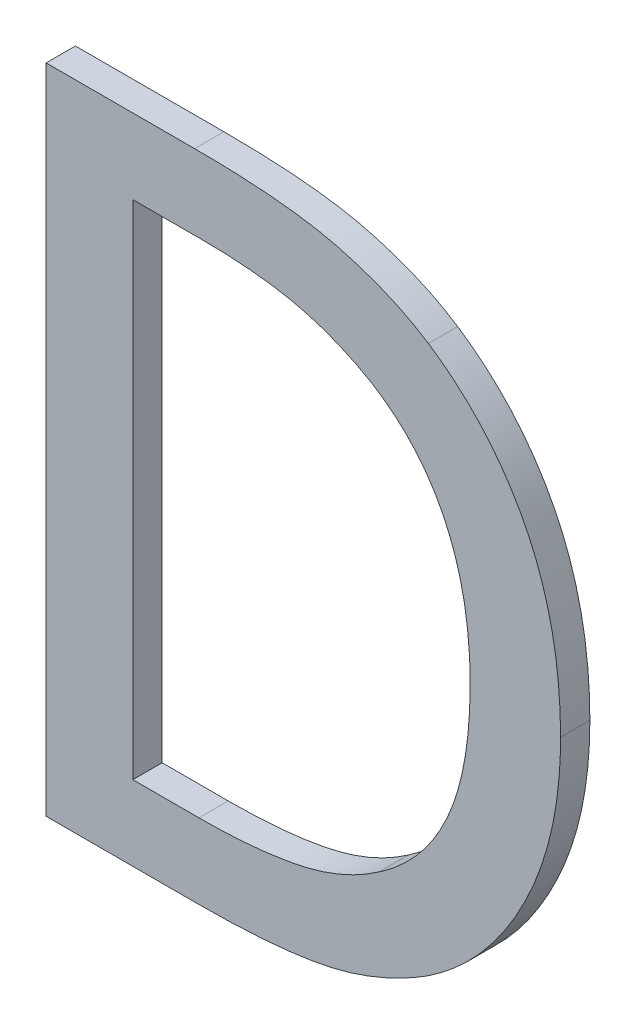
ISO-10303-21;
HEADER;
FILE_DESCRIPTION(('STEP AP214'),'2;1');
FILE_NAME('part.step','',(''),(''),'','','');
FILE_SCHEMA(('AUTOMOTIVE_DESIGN { 1 0 10303 214 1 1 1 1 }'));
ENDSEC;
DATA;
#1=APPLICATION_CONTEXT('core data for automotive mechanical design processes');
#2=APPLICATION_PROTOCOL_DEFINITION('international standard','automotive_design',2000,#1);
#3=PRODUCT_CONTEXT('',#1,'mechanical');
#4=PRODUCT('Part','Part','',(#3));
#5=PRODUCT_RELATED_PRODUCT_CATEGORY('part','',(#4));
#6=PRODUCT_DEFINITION_FORMATION('','',#4);
#7=PRODUCT_DEFINITION_CONTEXT('part definition',#1,'design');
#8=PRODUCT_DEFINITION('design','',#6,#7);
#9=PRODUCT_DEFINITION_SHAPE('','',#8);
#10=(LENGTH_UNIT() NAMED_UNIT(*) SI_UNIT(.MILLI.,.METRE.));
#11=(NAMED_UNIT(*) PLANE_ANGLE_UNIT() SI_UNIT($,.RADIAN.));
#12=(NAMED_UNIT(*) SI_UNIT($,.STERADIAN.) SOLID_ANGLE_UNIT());
#13=UNCERTAINTY_MEASURE_WITH_UNIT(LENGTH_MEASURE(1.E-05),#10,'distance_accuracy_value','');
#14=(GEOMETRIC_REPRESENTATION_CONTEXT(3) GLOBAL_UNCERTAINTY_ASSIGNED_CONTEXT((#13)) GLOBAL_UNIT_ASSIGNED_CONTEXT((#10,
#11,#12)) REPRESENTATION_CONTEXT('',''));
#15=CARTESIAN_POINT('',(0.,0.,0.));
#16=DIRECTION('',(0.,0.,1.));
#17=DIRECTION('',(1.,0.,0.));
#18=AXIS2_PLACEMENT_3D('',#15,#16,#17);
#19=CARTESIAN_POINT('',(-1.1720498035,-1.3331713862609,0.00415));
#20=DIRECTION('',(0.,0.,1.));
#21=DIRECTION('',(1.,0.,0.));
#22=AXIS2_PLACEMENT_3D('',#19,#20,#21);
#23=PLANE('',#22);
#24=CARTESIAN_POINT('',(-1.1507624098546,-1.3640414116441,0.00415));
#25=CARTESIAN_POINT('',(-1.1439127341829,-1.3595146694611,0.00415));
#26=CARTESIAN_POINT('',(-1.1357526857739,-1.3433136974374,0.00415));
#27=CARTESIAN_POINT('',(-1.1357526857739,-1.3332476523198,0.00415));
#28=B_SPLINE_CURVE_WITH_KNOTS('',2,(#24,#25,#26,#27),.UNSPECIFIED.,.F.,.F.,(3,1,3),(-2.,-1.,0.),.UNSPECIFIED.);
#29=CARTESIAN_POINT('',(-1.1507624098546,-1.3640414116441,0.00415));
#30=VERTEX_POINT('',#29);
#31=CARTESIAN_POINT('',(-1.1357526857739,-1.3332476523198,0.00415));
#32=VERTEX_POINT('',#31);
#33=EDGE_CURVE('E11',#30,#32,#28,.T.);
#34=ORIENTED_EDGE('',*,*,#33,.T.);
#35=CARTESIAN_POINT('',(-1.1357526857739,-1.3332476523198,0.00415));
#36=CARTESIAN_POINT('',(-1.1357526857739,-1.3225264208336,0.00415));
#37=CARTESIAN_POINT('',(-1.1435553598,-1.3069806351786,0.00415));
#38=CARTESIAN_POINT('',(-1.1506432850603,-1.3022752058041,0.00415));
#39=B_SPLINE_CURVE_WITH_KNOTS('',2,(#35,#36,#37,#38),.UNSPECIFIED.,.F.,.F.,(3,1,3),(-2.,-1.,0.),.UNSPECIFIED.);
#40=CARTESIAN_POINT('',(-1.1506432850603,-1.3022752058041,0.00415));
#41=VERTEX_POINT('',#40);
#42=EDGE_CURVE('E26',#32,#41,#39,.T.);
#43=ORIENTED_EDGE('',*,*,#42,.T.);
#44=CARTESIAN_POINT('',(-1.1506432850603,-1.3022752058041,0.00415));
#45=CARTESIAN_POINT('',(-1.1548126528605,-1.2995353355354,0.00415));
#46=CARTESIAN_POINT('',(-1.1666060074954,-1.2964380908838,0.00415));
#47=CARTESIAN_POINT('',(-1.1769698645987,-1.2964380908838,0.00415));
#48=B_SPLINE_CURVE_WITH_KNOTS('',2,(#44,#45,#46,#47),.UNSPECIFIED.,.F.,.F.,(3,1,3),(-2.,-1.,0.),.UNSPECIFIED.);
#49=CARTESIAN_POINT('',(-1.1769698645987,-1.2964380908838,0.00415));
#50=VERTEX_POINT('',#49);
#51=EDGE_CURVE('E290',#41,#50,#48,.T.);
#52=ORIENTED_EDGE('',*,*,#51,.T.);
#53=DIRECTION('',(-1.,0.,0.));
#54=VECTOR('',#53,1.);
#55=CARTESIAN_POINT('',(-1.1769698645987,-1.2964380908838,0.00415));
#56=LINE('',#55,#54);
#57=CARTESIAN_POINT('',(-1.1937068981966,-1.2964380908838,0.00415));
#58=VERTEX_POINT('',#57);
#59=EDGE_CURVE('E288',#50,#58,#56,.T.);
#60=ORIENTED_EDGE('',*,*,#59,.T.);
#61=DIRECTION('',(0.,-1.,0.));
#62=VECTOR('',#61,1.);
#63=CARTESIAN_POINT('',(-1.1937068981966,-1.2964380908838,0.00415));
#64=LINE('',#63,#62);
#65=CARTESIAN_POINT('',(-1.1937068981966,-1.3699380889616,0.00415));
#66=VERTEX_POINT('',#65);
#67=EDGE_CURVE('E286',#58,#66,#64,.T.);
#68=ORIENTED_EDGE('',*,*,#67,.T.);
#69=DIRECTION('',(1.,0.,0.));
#70=VECTOR('',#69,1.);
#71=CARTESIAN_POINT('',(-1.1937068981966,-1.3699380889616,0.00415));
#72=LINE('',#71,#70);
#73=CARTESIAN_POINT('',(-1.1767911774073,-1.3699380889616,0.00415));
#74=VERTEX_POINT('',#73);
#75=EDGE_CURVE('E281',#66,#74,#72,.T.);
#76=ORIENTED_EDGE('',*,*,#75,.T.);
#77=CARTESIAN_POINT('',(-1.1767911774073,-1.3699380889616,0.00415));
#78=CARTESIAN_POINT('',(-1.1678568178354,-1.3699380889616,0.00415));
#79=CARTESIAN_POINT('',(-1.1563612751863,-1.3675555930757,0.00415));
#80=CARTESIAN_POINT('',(-1.1507624098546,-1.3640414116441,0.00415));
#81=B_SPLINE_CURVE_WITH_KNOTS('',2,(#77,#78,#79,#80),.UNSPECIFIED.,.F.,.F.,(3,1,3),(-2.,-1.,0.),.UNSPECIFIED.);
#82=EDGE_CURVE('E274',#74,#30,#81,.T.);
#83=ORIENTED_EDGE('',*,*,#82,.T.);
#84=EDGE_LOOP('',(#34,#43,#52,#60,#68,#76,#83));
#85=FACE_BOUND('',#84,.T.);
#86=CARTESIAN_POINT('',(-1.1561825879949,-1.3565961120009,0.00415));
#87=CARTESIAN_POINT('',(-1.1601732686036,-1.3593955446668,0.00415));
#88=CARTESIAN_POINT('',(-1.1700010641326,-1.3614802285669,0.00415));
#89=CARTESIAN_POINT('',(-1.1764933654215,-1.3614802285669,0.00415));
#90=B_SPLINE_CURVE_WITH_KNOTS('',2,(#86,#87,#88,#89),.UNSPECIFIED.,.F.,.F.,(3,1,3),(-2.,-1.,0.),.UNSPECIFIED.);
#91=CARTESIAN_POINT('',(-1.1561825879949,-1.3565961120009,0.00415));
#92=VERTEX_POINT('',#91);
#93=CARTESIAN_POINT('',(-1.1764933654215,-1.3614802285669,0.00415));
#94=VERTEX_POINT('',#93);
#95=EDGE_CURVE('E270',#92,#94,#90,.T.);
#96=ORIENTED_EDGE('',*,*,#95,.T.);
#97=DIRECTION('',(-1.,0.,0.));
#98=VECTOR('',#97,1.);
#99=CARTESIAN_POINT('',(-1.1779942342824,-1.3614802285669,0.00415));
#100=LINE('',#99,#98);
#101=CARTESIAN_POINT('',(-1.1839386650647,-1.3614802285669,0.00415));
#102=VERTEX_POINT('',#101);
#103=EDGE_CURVE('E268',#94,#102,#100,.T.);
#104=ORIENTED_EDGE('',*,*,#103,.T.);
#105=DIRECTION('',(0.,1.,0.));
#106=VECTOR('',#105,1.);
#107=CARTESIAN_POINT('',(-1.1839386650647,-1.3190336687697,0.00415));
#108=LINE('',#107,#106);
#109=CARTESIAN_POINT('',(-1.1839386650647,-1.3048959512785,0.00415));
#110=VERTEX_POINT('',#109);
#111=EDGE_CURVE('E266',#102,#110,#108,.T.);
#112=ORIENTED_EDGE('',*,*,#111,.T.);
#113=DIRECTION('',(1.,0.,0.));
#114=VECTOR('',#113,1.);
#115=CARTESIAN_POINT('',(-1.1742715844608,-1.3048959512785,0.00415));
#116=LINE('',#115,#114);
#117=CARTESIAN_POINT('',(-1.1764933654215,-1.3048959512785,0.00415));
#118=VERTEX_POINT('',#117);
#119=EDGE_CURVE('E261',#110,#118,#116,.T.);
#120=ORIENTED_EDGE('',*,*,#119,.T.);
#121=CARTESIAN_POINT('',(-1.1764933654215,-1.3048959512785,0.00415));
#122=CARTESIAN_POINT('',(-1.1698819393384,-1.3048959512785,0.00415));
#123=CARTESIAN_POINT('',(-1.1610071421637,-1.3069806351786,0.00415));
#124=CARTESIAN_POINT('',(-1.1570760239521,-1.3093035686673,0.00415));
#125=B_SPLINE_CURVE_WITH_KNOTS('',2,(#121,#122,#123,#124),.UNSPECIFIED.,.F.,.F.,(3,1,3),(-2.,
-1.,0.),.UNSPECIFIED.);
#126=CARTESIAN_POINT('',(-1.1570760239521,-1.3093035686673,0.00415));
#127=VERTEX_POINT('',#126);
#128=EDGE_CURVE('E254',#118,#127,#125,.T.);
#129=ORIENTED_EDGE('',*,*,#128,.T.);
#130=CARTESIAN_POINT('',(-1.1570760239521,-1.3093035686673,0.00415));
#131=CARTESIAN_POINT('',(-1.1515367210175,-1.3126986253046,0.00415));
#132=CARTESIAN_POINT('',(-1.1459378556858,-1.3246706671308,0.00415));
#133=CARTESIAN_POINT('',(-1.1459378556858,-1.3331285275255,0.00415));
#134=B_SPLINE_CURVE_WITH_KNOTS('',2,(#130,#131,#132,#133),.UNSPECIFIED.,.F.,.F.,(3,1,3),(-2.,
-1.,0.),.UNSPECIFIED.);
#135=CARTESIAN_POINT('',(-1.1459378556858,-1.3331285275255,0.00415));
#136=VERTEX_POINT('',#135);
#137=EDGE_CURVE('E247',#127,#136,#134,.T.);
#138=ORIENTED_EDGE('',*,*,#137,.T.);
#139=CARTESIAN_POINT('',(-1.1459378556858,-1.3331285275255,0.00415));
#140=CARTESIAN_POINT('',(-1.1459378556858,-1.3417055127145,0.00415));
#141=CARTESIAN_POINT('',(-1.1510602218403,-1.3531414929665,0.00415));
#142=CARTESIAN_POINT('',(-1.1561825879949,-1.3565961120009,0.00415));
#143=B_SPLINE_CURVE_WITH_KNOTS('',2,(#139,#140,#141,#142),.UNSPECIFIED.,.F.,.F.,(3,1,3),(-2.,
-1.,0.),.UNSPECIFIED.);
#144=EDGE_CURVE('E239',#136,#92,#143,.T.);
#145=ORIENTED_EDGE('',*,*,#144,.T.);
#146=EDGE_LOOP('',(#96,#104,#112,#120,#129,#138,#145));
#147=FACE_BOUND('',#146,.T.);
#148=ADVANCED_FACE('F17',(#85,#147),#23,.T.);
#149=CARTESIAN_POINT('',(-1.1561825879949,-1.3565961120009,0.00085));
#150=CARTESIAN_POINT('',(-1.1561825879949,-1.3565961120009,0.00415));
#151=CARTESIAN_POINT('',(-1.1510602218403,-1.3531414929665,0.00085));
#152=CARTESIAN_POINT('',(-1.1510602218403,-1.3531414929665,0.00415));
#153=CARTESIAN_POINT('',(-1.1459378556858,-1.3417055127145,0.00085));
#154=CARTESIAN_POINT('',(-1.1459378556858,-1.3417055127145,0.00415));
#155=CARTESIAN_POINT('',(-1.1459378556858,-1.3331285275255,0.00085));
#156=CARTESIAN_POINT('',(-1.1459378556858,-1.3331285275255,0.00415));
#157=B_SPLINE_SURFACE_WITH_KNOTS('',2,1,((#149,#150),(#151,#152),(#153,#154),(#155,#156)),
.UNSPECIFIED.,.F.,.F.,.F.,(3,1,3),(2,2),(0.,1.,2.),(0.,0.0022),.UNSPECIFIED.);
#158=CARTESIAN_POINT('',(-1.1561825879949,-1.3565961120009,0.00085));
#159=CARTESIAN_POINT('',(-1.1510602218403,-1.3531414929665,0.00085));
#160=CARTESIAN_POINT('',(-1.1459378556858,-1.3417055127145,0.00085));
#161=CARTESIAN_POINT('',(-1.1459378556858,-1.3331285275255,0.00085));
#162=B_SPLINE_CURVE_WITH_KNOTS('',2,(#158,#159,#160,#161),.UNSPECIFIED.,.F.,.F.,(3,1,3),(0.,1.,
2.),.UNSPECIFIED.);
#163=CARTESIAN_POINT('',(-1.1561825879949,-1.3565961120009,0.00085));
#164=VERTEX_POINT('',#163);
#165=CARTESIAN_POINT('',(-1.1459378556858,-1.3331285275255,0.00085));
#166=VERTEX_POINT('',#165);
#167=EDGE_CURVE('E234',#164,#166,#162,.T.);
#168=DIRECTION('',(0.,0.,1.));
#169=VECTOR('',#168,1.);
#170=CARTESIAN_POINT('',(-1.1561825879949,-1.3565961120009,0.00115));
#171=LINE('',#170,#169);
#172=EDGE_CURVE('E231',#164,#92,#171,.T.);
#173=DIRECTION('',(0.,0.,1.));
#174=VECTOR('',#173,1.);
#175=CARTESIAN_POINT('',(-1.1459378556858,-1.3331285275255,0.00085));
#176=LINE('',#175,#174);
#177=EDGE_CURVE('E225',#166,#136,#176,.T.);
#178=ORIENTED_EDGE('',*,*,#167,.F.);
#179=ORIENTED_EDGE('',*,*,#172,.T.);
#180=ORIENTED_EDGE('',*,*,#144,.F.);
#181=ORIENTED_EDGE('',*,*,#177,.F.);
#182=EDGE_LOOP('',(#178,#179,#180,#181));
#183=FACE_BOUND('',#182,.T.);
#184=ADVANCED_FACE('F339',(#183),#157,.F.);
#185=CARTESIAN_POINT('',(-1.1764933654215,-1.3614802285669,0.00085));
#186=CARTESIAN_POINT('',(-1.1764933654215,-1.3614802285669,0.00415));
#187=CARTESIAN_POINT('',(-1.1700010641326,-1.3614802285669,0.00085));
#188=CARTESIAN_POINT('',(-1.1700010641326,-1.3614802285669,0.00415));
#189=CARTESIAN_POINT('',(-1.1601732686036,-1.3593955446668,0.00085));
#190=CARTESIAN_POINT('',(-1.1601732686036,-1.3593955446668,0.00415));
#191=CARTESIAN_POINT('',(-1.1561825879949,-1.3565961120009,0.00085));
#192=CARTESIAN_POINT('',(-1.1561825879949,-1.3565961120009,0.00415));
#193=B_SPLINE_SURFACE_WITH_KNOTS('',2,1,((#185,#186),(#187,#188),(#189,#190),(#191,#192)),
.UNSPECIFIED.,.F.,.F.,.F.,(3,1,3),(2,2),(0.,1.,2.),(0.,0.0022),.UNSPECIFIED.);
#194=CARTESIAN_POINT('',(-1.1764933654215,-1.3614802285669,0.00085));
#195=CARTESIAN_POINT('',(-1.1700010641326,-1.3614802285669,0.00085));
#196=CARTESIAN_POINT('',(-1.1601732686036,-1.3593955446668,0.00085));
#197=CARTESIAN_POINT('',(-1.1561825879949,-1.3565961120009,0.00085));
#198=B_SPLINE_CURVE_WITH_KNOTS('',2,(#194,#195,#196,#197),.UNSPECIFIED.,.F.,.F.,(3,1,3),(0.,1.,
2.),.UNSPECIFIED.);
#199=CARTESIAN_POINT('',(-1.1764933654215,-1.3614802285669,0.00085));
#200=VERTEX_POINT('',#199);
#201=EDGE_CURVE('E220',#200,#164,#198,.T.);
#202=DIRECTION('',(0.,0.,1.));
#203=VECTOR('',#202,1.);
#204=CARTESIAN_POINT('',(-1.1764933654215,-1.3614802285669,0.00115));
#205=LINE('',#204,#203);
#206=EDGE_CURVE('E217',#200,#94,#205,.T.);
#207=ORIENTED_EDGE('',*,*,#201,.F.);
#208=ORIENTED_EDGE('',*,*,#206,.T.);
#209=ORIENTED_EDGE('',*,*,#95,.F.);
#210=ORIENTED_EDGE('',*,*,#172,.F.);
#211=EDGE_LOOP('',(#207,#208,#209,#210));
#212=FACE_BOUND('',#211,.T.);
#213=ADVANCED_FACE('F343',(#212),#193,.F.);
#214=CARTESIAN_POINT('',(-1.1839386650647,-1.3614802285669,0.00085));
#215=DIRECTION('',(0.,-1.,0.));
#216=DIRECTION('',(1.,0.,0.));
#217=AXIS2_PLACEMENT_3D('',#214,#215,#216);
#218=PLANE('',#217);
#219=DIRECTION('',(1.,0.,0.));
#220=VECTOR('',#219,1.);
#221=CARTESIAN_POINT('',(-1.1779942342824,-1.3614802285669,0.00085));
#222=LINE('',#221,#220);
#223=CARTESIAN_POINT('',(-1.1839386650647,-1.3614802285669,0.00085));
#224=VERTEX_POINT('',#223);
#225=EDGE_CURVE('E214',#224,#200,#222,.T.);
#226=ORIENTED_EDGE('',*,*,#225,.F.);
#227=DIRECTION('',(0.,0.,1.));
#228=VECTOR('',#227,1.);
#229=CARTESIAN_POINT('',(-1.1839386650647,-1.3614802285669,0.00115));
#230=LINE('',#229,#228);
#231=EDGE_CURVE('E211',#224,#102,#230,.T.);
#232=ORIENTED_EDGE('',*,*,#231,.T.);
#233=ORIENTED_EDGE('',*,*,#103,.F.);
#234=ORIENTED_EDGE('',*,*,#206,.F.);
#235=EDGE_LOOP('',(#226,#232,#233,#234));
#236=FACE_BOUND('',#235,.T.);
#237=ADVANCED_FACE('F348',(#236),#218,.F.);
#238=CARTESIAN_POINT('',(-1.1839386650647,-1.3048959512785,0.00085));
#239=DIRECTION('',(-1.,0.,0.));
#240=DIRECTION('',(0.,-1.,0.));
#241=AXIS2_PLACEMENT_3D('',#238,#239,#240);
#242=PLANE('',#241);
#243=DIRECTION('',(0.,-1.,0.));
#244=VECTOR('',#243,1.);
#245=CARTESIAN_POINT('',(-1.1839386650647,-1.3190336687697,0.00085));
#246=LINE('',#245,#244);
#247=CARTESIAN_POINT('',(-1.1839386650647,-1.3048959512785,0.00085));
#248=VERTEX_POINT('',#247);
#249=EDGE_CURVE('E208',#248,#224,#246,.T.);
#250=ORIENTED_EDGE('',*,*,#249,.F.);
#251=DIRECTION('',(0.,0.,1.));
#252=VECTOR('',#251,1.);
#253=CARTESIAN_POINT('',(-1.1839386650647,-1.3048959512785,0.00115));
#254=LINE('',#253,#252);
#255=EDGE_CURVE('E205',#248,#110,#254,.T.);
#256=ORIENTED_EDGE('',*,*,#255,.T.);
#257=ORIENTED_EDGE('',*,*,#111,.F.);
#258=ORIENTED_EDGE('',*,*,#231,.F.);
#259=EDGE_LOOP('',(#250,#256,#257,#258));
#260=FACE_BOUND('',#259,.T.);
#261=ADVANCED_FACE('F369',(#260),#242,.F.);
#262=CARTESIAN_POINT('',(-1.1764933654215,-1.3048959512785,0.00085));
#263=DIRECTION('',(0.,1.,0.));
#264=DIRECTION('',(-1.,0.,0.));
#265=AXIS2_PLACEMENT_3D('',#262,#263,#264);
#266=PLANE('',#265);
#267=DIRECTION('',(-1.,0.,0.));
#268=VECTOR('',#267,1.);
#269=CARTESIAN_POINT('',(-1.1742715844608,-1.3048959512785,0.00085));
#270=LINE('',#269,#268);
#271=CARTESIAN_POINT('',(-1.1764933654215,-1.3048959512785,0.00085));
#272=VERTEX_POINT('',#271);
#273=EDGE_CURVE('E202',#272,#248,#270,.T.);
#274=ORIENTED_EDGE('',*,*,#273,.F.);
#275=DIRECTION('',(0.,0.,1.));
#276=VECTOR('',#275,1.);
#277=CARTESIAN_POINT('',(-1.1764933654215,-1.3048959512785,0.00115));
#278=LINE('',#277,#276);
#279=EDGE_CURVE('E196',#272,#118,#278,.T.);
#280=ORIENTED_EDGE('',*,*,#279,.T.);
#281=ORIENTED_EDGE('',*,*,#119,.F.);
#282=ORIENTED_EDGE('',*,*,#255,.F.);
#283=EDGE_LOOP('',(#274,#280,#281,#282));
#284=FACE_BOUND('',#283,.T.);
#285=ADVANCED_FACE('F373',(#284),#266,.F.);
#286=CARTESIAN_POINT('',(-1.1570760239521,-1.3093035686673,0.00085));
#287=CARTESIAN_POINT('',(-1.1570760239521,-1.3093035686673,0.00415));
#288=CARTESIAN_POINT('',(-1.1610071421637,-1.3069806351786,0.00085));
#289=CARTESIAN_POINT('',(-1.1610071421637,-1.3069806351786,0.00415));
#290=CARTESIAN_POINT('',(-1.1698819393384,-1.3048959512785,0.00085));
#291=CARTESIAN_POINT('',(-1.1698819393384,-1.3048959512785,0.00415));
#292=CARTESIAN_POINT('',(-1.1764933654215,-1.3048959512785,0.00085));
#293=CARTESIAN_POINT('',(-1.1764933654215,-1.3048959512785,0.00415));
#294=B_SPLINE_SURFACE_WITH_KNOTS('',2,1,((#286,#287),(#288,#289),(#290,#291),(#292,#293)),
.UNSPECIFIED.,.F.,.F.,.F.,(3,1,3),(2,2),(0.,1.,2.),(0.,0.0022),.UNSPECIFIED.);
#295=CARTESIAN_POINT('',(-1.1570760239521,-1.3093035686673,0.00085));
#296=CARTESIAN_POINT('',(-1.1610071421637,-1.3069806351786,0.00085));
#297=CARTESIAN_POINT('',(-1.1698819393384,-1.3048959512785,0.00085));
#298=CARTESIAN_POINT('',(-1.1764933654215,-1.3048959512785,0.00085));
#299=B_SPLINE_CURVE_WITH_KNOTS('',2,(#295,#296,#297,#298),.UNSPECIFIED.,.F.,.F.,(3,1,3),(0.,1.,
2.),.UNSPECIFIED.);
#300=CARTESIAN_POINT('',(-1.1570760239521,-1.3093035686673,0.00085));
#301=VERTEX_POINT('',#300);
#302=EDGE_CURVE('E191',#301,#272,#299,.T.);
#303=DIRECTION('',(0.,0.,1.));
#304=VECTOR('',#303,1.);
#305=CARTESIAN_POINT('',(-1.1570760239521,-1.3093035686673,0.00115));
#306=LINE('',#305,#304);
#307=EDGE_CURVE('E185',#301,#127,#306,.T.);
#308=ORIENTED_EDGE('',*,*,#302,.F.);
#309=ORIENTED_EDGE('',*,*,#307,.T.);
#310=ORIENTED_EDGE('',*,*,#128,.F.);
#311=ORIENTED_EDGE('',*,*,#279,.F.);
#312=EDGE_LOOP('',(#308,#309,#310,#311));
#313=FACE_BOUND('',#312,.T.);
#314=ADVANCED_FACE('F333',(#313),#294,.F.);
#315=CARTESIAN_POINT('',(-1.1459378556858,-1.3331285275255,0.00085));
#316=CARTESIAN_POINT('',(-1.1459378556858,-1.3331285275255,0.00415));
#317=CARTESIAN_POINT('',(-1.1459378556858,-1.3246706671308,0.00085));
#318=CARTESIAN_POINT('',(-1.1459378556858,-1.3246706671308,0.00415));
#319=CARTESIAN_POINT('',(-1.1515367210175,-1.3126986253046,0.00085));
#320=CARTESIAN_POINT('',(-1.1515367210175,-1.3126986253046,0.00415));
#321=CARTESIAN_POINT('',(-1.1570760239521,-1.3093035686673,0.00085));
#322=CARTESIAN_POINT('',(-1.1570760239521,-1.3093035686673,0.00415));
#323=B_SPLINE_SURFACE_WITH_KNOTS('',2,1,((#315,#316),(#317,#318),(#319,#320),(#321,#322)),
.UNSPECIFIED.,.F.,.F.,.F.,(3,1,3),(2,2),(0.,1.,2.),(0.,0.0022),.UNSPECIFIED.);
#324=CARTESIAN_POINT('',(-1.1459378556858,-1.3331285275255,0.00085));
#325=CARTESIAN_POINT('',(-1.1459378556858,-1.3246706671308,0.00085));
#326=CARTESIAN_POINT('',(-1.1515367210175,-1.3126986253046,0.00085));
#327=CARTESIAN_POINT('',(-1.1570760239521,-1.3093035686673,0.00085));
#328=B_SPLINE_CURVE_WITH_KNOTS('',2,(#324,#325,#326,#327),.UNSPECIFIED.,.F.,.F.,(3,1,3),(0.,1.,
2.),.UNSPECIFIED.);
#329=EDGE_CURVE('E177',#166,#301,#328,.T.);
#330=ORIENTED_EDGE('',*,*,#329,.F.);
#331=ORIENTED_EDGE('',*,*,#177,.T.);
#332=ORIENTED_EDGE('',*,*,#137,.F.);
#333=ORIENTED_EDGE('',*,*,#307,.F.);
#334=EDGE_LOOP('',(#330,#331,#332,#333));
#335=FACE_BOUND('',#334,.T.);
#336=ADVANCED_FACE('F325',(#335),#323,.F.);
#337=CARTESIAN_POINT('',(-1.1767911774073,-1.3699380889616,0.00085));
#338=CARTESIAN_POINT('',(-1.1767911774073,-1.3699380889616,0.00415));
#339=CARTESIAN_POINT('',(-1.1678568178354,-1.3699380889616,0.00085));
#340=CARTESIAN_POINT('',(-1.1678568178354,-1.3699380889616,0.00415));
#341=CARTESIAN_POINT('',(-1.1563612751863,-1.3675555930757,0.00085));
#342=CARTESIAN_POINT('',(-1.1563612751863,-1.3675555930757,0.00415));
#343=CARTESIAN_POINT('',(-1.1507624098546,-1.3640414116441,0.00085));
#344=CARTESIAN_POINT('',(-1.1507624098546,-1.3640414116441,0.00415));
#345=B_SPLINE_SURFACE_WITH_KNOTS('',2,1,((#337,#338),(#339,#340),(#341,#342),(#343,#344)),
.UNSPECIFIED.,.F.,.F.,.F.,(3,1,3),(2,2),(-2.,-1.,0.),(0.,0.0022),.UNSPECIFIED.);
#346=CARTESIAN_POINT('',(-1.1507624098546,-1.3640414116441,0.00085));
#347=CARTESIAN_POINT('',(-1.1563612751863,-1.3675555930757,0.00085));
#348=CARTESIAN_POINT('',(-1.1678568178354,-1.3699380889616,0.00085));
#349=CARTESIAN_POINT('',(-1.1767911774073,-1.3699380889616,0.00085));
#350=B_SPLINE_CURVE_WITH_KNOTS('',2,(#346,#347,#348,#349),.UNSPECIFIED.,.F.,.F.,(3,1,3),(0.,1.,
2.),.UNSPECIFIED.);
#351=CARTESIAN_POINT('',(-1.1507624098546,-1.3640414116441,0.00085));
#352=VERTEX_POINT('',#351);
#353=CARTESIAN_POINT('',(-1.1767911774073,-1.3699380889616,0.00085));
#354=VERTEX_POINT('',#353);
#355=EDGE_CURVE('E173',#352,#354,#350,.T.);
#356=DIRECTION('',(0.,0.,1.));
#357=VECTOR('',#356,1.);
#358=CARTESIAN_POINT('',(-1.1507624098546,-1.3640414116441,0.00085));
#359=LINE('',#358,#357);
#360=EDGE_CURVE('E134',#352,#30,#359,.T.);
#361=DIRECTION('',(0.,0.,1.));
#362=VECTOR('',#361,1.);
#363=CARTESIAN_POINT('',(-1.1767911774073,-1.3699380889616,0.00085));
#364=LINE('',#363,#362);
#365=EDGE_CURVE('E169',#354,#74,#364,.T.);
#366=ORIENTED_EDGE('',*,*,#355,.F.);
#367=ORIENTED_EDGE('',*,*,#360,.T.);
#368=ORIENTED_EDGE('',*,*,#82,.F.);
#369=ORIENTED_EDGE('',*,*,#365,.F.);
#370=EDGE_LOOP('',(#366,#367,#368,#369));
#371=FACE_BOUND('',#370,.T.);
#372=ADVANCED_FACE('F323',(#371),#345,.T.);
#373=CARTESIAN_POINT('',(-1.1937068981966,-1.3699380889616,0.00085));
#374=DIRECTION('',(0.,-1.,0.));
#375=DIRECTION('',(1.,0.,0.));
#376=AXIS2_PLACEMENT_3D('',#373,#374,#375);
#377=PLANE('',#376);
#378=DIRECTION('',(-1.,0.,0.));
#379=VECTOR('',#378,1.);
#380=CARTESIAN_POINT('',(-1.1767911774073,-1.3699380889616,0.00085));
#381=LINE('',#380,#379);
#382=CARTESIAN_POINT('',(-1.1937068981966,-1.3699380889616,0.00085));
#383=VERTEX_POINT('',#382);
#384=EDGE_CURVE('E167',#354,#383,#381,.T.);
#385=ORIENTED_EDGE('',*,*,#384,.F.);
#386=ORIENTED_EDGE('',*,*,#365,.T.);
#387=ORIENTED_EDGE('',*,*,#75,.F.);
#388=DIRECTION('',(0.,0.,1.));
#389=VECTOR('',#388,1.);
#390=CARTESIAN_POINT('',(-1.1937068981966,-1.3699380889616,0.00085));
#391=LINE('',#390,#389);
#392=EDGE_CURVE('E164',#383,#66,#391,.T.);
#393=ORIENTED_EDGE('',*,*,#392,.F.);
#394=EDGE_LOOP('',(#385,#386,#387,#393));
#395=FACE_BOUND('',#394,.T.);
#396=ADVANCED_FACE('F319',(#395),#377,.T.);
#397=CARTESIAN_POINT('',(-1.1937068981966,-1.2964380908838,0.00085));
#398=DIRECTION('',(-1.,0.,0.));
#399=DIRECTION('',(0.,-1.,0.));
#400=AXIS2_PLACEMENT_3D('',#397,#398,#399);
#401=PLANE('',#400);
#402=DIRECTION('',(0.,1.,0.));
#403=VECTOR('',#402,1.);
#404=CARTESIAN_POINT('',(-1.1937068981966,-1.3699380889616,0.00085));
#405=LINE('',#404,#403);
#406=CARTESIAN_POINT('',(-1.1937068981966,-1.2964380908838,0.00085));
#407=VERTEX_POINT('',#406);
#408=EDGE_CURVE('E162',#383,#407,#405,.T.);
#409=ORIENTED_EDGE('',*,*,#408,.F.);
#410=ORIENTED_EDGE('',*,*,#392,.T.);
#411=ORIENTED_EDGE('',*,*,#67,.F.);
#412=DIRECTION('',(0.,0.,1.));
#413=VECTOR('',#412,1.);
#414=CARTESIAN_POINT('',(-1.1937068981966,-1.2964380908838,0.00085));
#415=LINE('',#414,#413);
#416=EDGE_CURVE('E159',#407,#58,#415,.T.);
#417=ORIENTED_EDGE('',*,*,#416,.F.);
#418=EDGE_LOOP('',(#409,#410,#411,#417));
#419=FACE_BOUND('',#418,.T.);
#420=ADVANCED_FACE('F315',(#419),#401,.T.);
#421=CARTESIAN_POINT('',(-1.1769698645987,-1.2964380908838,0.00085));
#422=DIRECTION('',(0.,1.,0.));
#423=DIRECTION('',(-1.,0.,0.));
#424=AXIS2_PLACEMENT_3D('',#421,#422,#423);
#425=PLANE('',#424);
#426=DIRECTION('',(1.,0.,0.));
#427=VECTOR('',#426,1.);
#428=CARTESIAN_POINT('',(-1.1937068981966,-1.2964380908838,0.00085));
#429=LINE('',#428,#427);
#430=CARTESIAN_POINT('',(-1.1769698645987,-1.2964380908838,0.00085));
#431=VERTEX_POINT('',#430);
#432=EDGE_CURVE('E157',#407,#431,#429,.T.);
#433=ORIENTED_EDGE('',*,*,#432,.F.);
#434=ORIENTED_EDGE('',*,*,#416,.T.);
#435=ORIENTED_EDGE('',*,*,#59,.F.);
#436=DIRECTION('',(0.,0.,1.));
#437=VECTOR('',#436,1.);
#438=CARTESIAN_POINT('',(-1.1769698645987,-1.2964380908838,0.00085));
#439=LINE('',#438,#437);
#440=EDGE_CURVE('E151',#431,#50,#439,.T.);
#441=ORIENTED_EDGE('',*,*,#440,.F.);
#442=EDGE_LOOP('',(#433,#434,#435,#441));
#443=FACE_BOUND('',#442,.T.);
#444=ADVANCED_FACE('F309',(#443),#425,.T.);
#445=CARTESIAN_POINT('',(-1.1506432850603,-1.3022752058041,0.00085));
#446=CARTESIAN_POINT('',(-1.1506432850603,-1.3022752058041,0.00415));
#447=CARTESIAN_POINT('',(-1.1548126528605,-1.2995353355354,0.00085));
#448=CARTESIAN_POINT('',(-1.1548126528605,-1.2995353355354,0.00415));
#449=CARTESIAN_POINT('',(-1.1666060074954,-1.2964380908838,0.00085));
#450=CARTESIAN_POINT('',(-1.1666060074954,-1.2964380908838,0.00415));
#451=CARTESIAN_POINT('',(-1.1769698645987,-1.2964380908838,0.00085));
#452=CARTESIAN_POINT('',(-1.1769698645987,-1.2964380908838,0.00415));
#453=B_SPLINE_SURFACE_WITH_KNOTS('',2,1,((#445,#446),(#447,#448),(#449,#450),(#451,#452)),
.UNSPECIFIED.,.F.,.F.,.F.,(3,1,3),(2,2),(-2.,-1.,0.),(0.,0.0022),.UNSPECIFIED.);
#454=CARTESIAN_POINT('',(-1.1769698645987,-1.2964380908838,0.00085));
#455=CARTESIAN_POINT('',(-1.1666060074954,-1.2964380908838,0.00085));
#456=CARTESIAN_POINT('',(-1.1548126528605,-1.2995353355354,0.00085));
#457=CARTESIAN_POINT('',(-1.1506432850603,-1.3022752058041,0.00085));
#458=B_SPLINE_CURVE_WITH_KNOTS('',2,(#454,#455,#456,#457),.UNSPECIFIED.,.F.,.F.,(3,1,3),(0.,1.,
2.),.UNSPECIFIED.);
#459=CARTESIAN_POINT('',(-1.1506432850603,-1.3022752058041,0.00085));
#460=VERTEX_POINT('',#459);
#461=EDGE_CURVE('E123',#431,#460,#458,.T.);
#462=DIRECTION('',(0.,0.,1.));
#463=VECTOR('',#462,1.);
#464=CARTESIAN_POINT('',(-1.1506432850603,-1.3022752058041,0.00085));
#465=LINE('',#464,#463);
#466=EDGE_CURVE('E127',#460,#41,#465,.T.);
#467=ORIENTED_EDGE('',*,*,#461,.F.);
#468=ORIENTED_EDGE('',*,*,#440,.T.);
#469=ORIENTED_EDGE('',*,*,#51,.F.);
#470=ORIENTED_EDGE('',*,*,#466,.F.);
#471=EDGE_LOOP('',(#467,#468,#469,#470));
#472=FACE_BOUND('',#471,.T.);
#473=ADVANCED_FACE('F305',(#472),#453,.T.);
#474=CARTESIAN_POINT('',(-1.1357526857739,-1.3332476523198,0.00085));
#475=CARTESIAN_POINT('',(-1.1357526857739,-1.3332476523198,0.00415));
#476=CARTESIAN_POINT('',(-1.1357526857739,-1.3225264208336,0.00085));
#477=CARTESIAN_POINT('',(-1.1357526857739,-1.3225264208336,0.00415));
#478=CARTESIAN_POINT('',(-1.1435553598,-1.3069806351786,0.00085));
#479=CARTESIAN_POINT('',(-1.1435553598,-1.3069806351786,0.00415));
#480=CARTESIAN_POINT('',(-1.1506432850603,-1.3022752058041,0.00085));
#481=CARTESIAN_POINT('',(-1.1506432850603,-1.3022752058041,0.00415));
#482=B_SPLINE_SURFACE_WITH_KNOTS('',2,1,((#474,#475),(#476,#477),(#478,#479),(#480,#481)),
.UNSPECIFIED.,.F.,.F.,.F.,(3,1,3),(2,2),(-2.,-1.,0.),(0.,0.0022),.UNSPECIFIED.);
#483=CARTESIAN_POINT('',(-1.1506432850603,-1.3022752058041,0.00085));
#484=CARTESIAN_POINT('',(-1.1435553598,-1.3069806351786,0.00085));
#485=CARTESIAN_POINT('',(-1.1357526857739,-1.3225264208336,0.00085));
#486=CARTESIAN_POINT('',(-1.1357526857739,-1.3332476523198,0.00085));
#487=B_SPLINE_CURVE_WITH_KNOTS('',2,(#483,#484,#485,#486),.UNSPECIFIED.,.F.,.F.,(3,1,3),(0.,1.,
2.),.UNSPECIFIED.);
#488=CARTESIAN_POINT('',(-1.1357526857739,-1.3332476523198,0.00085));
#489=VERTEX_POINT('',#488);
#490=EDGE_CURVE('E116',#460,#489,#487,.T.);
#491=DIRECTION('',(0.,0.,1.));
#492=VECTOR('',#491,1.);
#493=CARTESIAN_POINT('',(-1.1357526857739,-1.3332476523198,0.00085));
#494=LINE('',#493,#492);
#495=EDGE_CURVE('E128',#489,#32,#494,.T.);
#496=ORIENTED_EDGE('',*,*,#490,.F.);
#497=ORIENTED_EDGE('',*,*,#466,.T.);
#498=ORIENTED_EDGE('',*,*,#42,.F.);
#499=ORIENTED_EDGE('',*,*,#495,.F.);
#500=EDGE_LOOP('',(#496,#497,#498,#499));
#501=FACE_BOUND('',#500,.T.);
#502=ADVANCED_FACE('F130',(#501),#482,.T.);
#503=CARTESIAN_POINT('',(-1.1507624098546,-1.3640414116441,0.00085));
#504=CARTESIAN_POINT('',(-1.1507624098546,-1.3640414116441,0.00415));
#505=CARTESIAN_POINT('',(-1.1439127341829,-1.3595146694611,0.00085));
#506=CARTESIAN_POINT('',(-1.1439127341829,-1.3595146694611,0.00415));
#507=CARTESIAN_POINT('',(-1.1357526857739,-1.3433136974374,0.00085));
#508=CARTESIAN_POINT('',(-1.1357526857739,-1.3433136974374,0.00415));
#509=CARTESIAN_POINT('',(-1.1357526857739,-1.3332476523198,0.00085));
#510=CARTESIAN_POINT('',(-1.1357526857739,-1.3332476523198,0.00415));
#511=B_SPLINE_SURFACE_WITH_KNOTS('',2,1,((#503,#504),(#505,#506),(#507,#508),(#509,#510)),
.UNSPECIFIED.,.F.,.F.,.F.,(3,1,3),(2,2),(-2.,-1.,0.),(0.,0.0022),.UNSPECIFIED.);
#512=CARTESIAN_POINT('',(-1.1357526857739,-1.3332476523198,0.00085));
#513=CARTESIAN_POINT('',(-1.1357526857739,-1.3433136974374,0.00085));
#514=CARTESIAN_POINT('',(-1.1439127341829,-1.3595146694611,0.00085));
#515=CARTESIAN_POINT('',(-1.1507624098546,-1.3640414116441,0.00085));
#516=B_SPLINE_CURVE_WITH_KNOTS('',2,(#512,#513,#514,#515),.UNSPECIFIED.,.F.,.F.,(3,1,3),(0.,1.,
2.),.UNSPECIFIED.);
#517=EDGE_CURVE('E121',#489,#352,#516,.T.);
#518=ORIENTED_EDGE('',*,*,#517,.F.);
#519=ORIENTED_EDGE('',*,*,#495,.T.);
#520=ORIENTED_EDGE('',*,*,#33,.F.);
#521=ORIENTED_EDGE('',*,*,#360,.F.);
#522=EDGE_LOOP('',(#518,#519,#520,#521));
#523=FACE_BOUND('',#522,.T.);
#524=ADVANCED_FACE('F132',(#523),#511,.T.);
#525=CARTESIAN_POINT('',(-1.1720498035,-1.3331713862609,0.00085));
#526=DIRECTION('',(0.,0.,1.));
#527=DIRECTION('',(1.,0.,0.));
#528=AXIS2_PLACEMENT_3D('',#525,#526,#527);
#529=PLANE('',#528);
#530=ORIENTED_EDGE('',*,*,#517,.T.);
#531=ORIENTED_EDGE('',*,*,#355,.T.);
#532=ORIENTED_EDGE('',*,*,#384,.T.);
#533=ORIENTED_EDGE('',*,*,#408,.T.);
#534=ORIENTED_EDGE('',*,*,#432,.T.);
#535=ORIENTED_EDGE('',*,*,#461,.T.);
#536=ORIENTED_EDGE('',*,*,#490,.T.);
#537=EDGE_LOOP('',(#530,#531,#532,#533,#534,#535,#536));
#538=FACE_BOUND('',#537,.T.);
#539=ORIENTED_EDGE('',*,*,#167,.T.);
#540=ORIENTED_EDGE('',*,*,#329,.T.);
#541=ORIENTED_EDGE('',*,*,#302,.T.);
#542=ORIENTED_EDGE('',*,*,#273,.T.);
#543=ORIENTED_EDGE('',*,*,#249,.T.);
#544=ORIENTED_EDGE('',*,*,#225,.T.);
#545=ORIENTED_EDGE('',*,*,#201,.T.);
#546=EDGE_LOOP('',(#539,#540,#541,#542,#543,#544,#545));
#547=FACE_BOUND('',#546,.T.);
#548=ADVANCED_FACE('F118',(#538,#547),#529,.F.);
#549=CLOSED_SHELL('',(#148,#184,#213,#237,#261,#285,#314,#336,#372,#396,#420,#444,#473,#502,
#524,#548));
#550=MANIFOLD_SOLID_BREP('B1',#549);
#551=ADVANCED_BREP_SHAPE_REPRESENTATION('',(#18,#550),#14);
#552=SHAPE_DEFINITION_REPRESENTATION(#9,#551);
ENDSEC;
END-ISO-10303-21;
